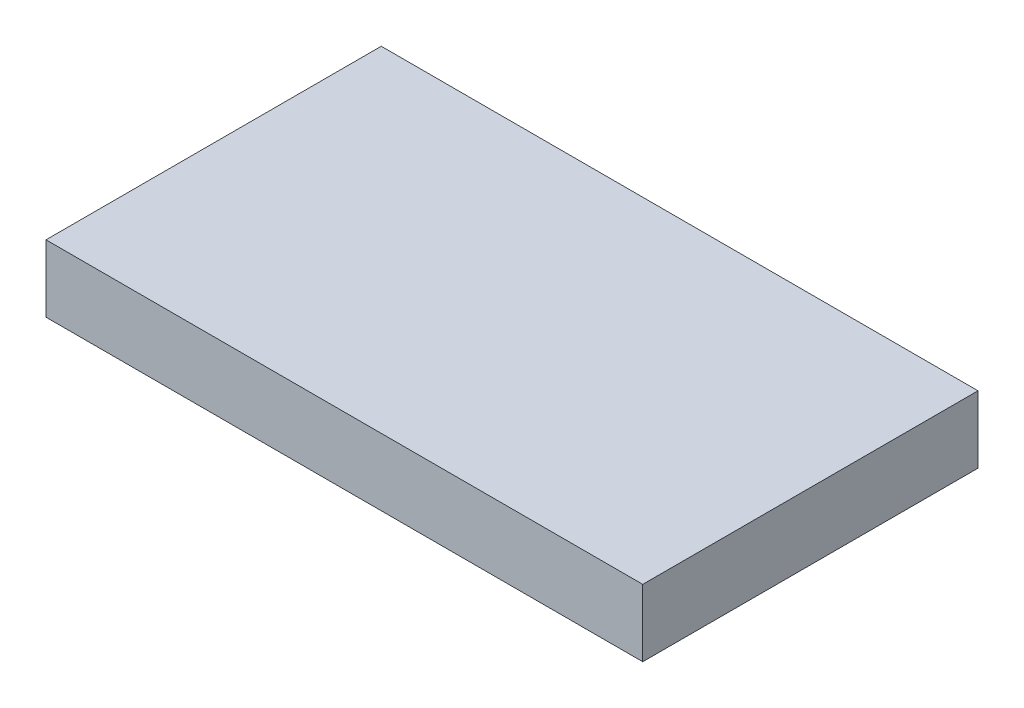
ISO-10303-21;
HEADER;
FILE_DESCRIPTION(('STEP AP214'),'2;1');
FILE_NAME('part.step','',(''),(''),'','','');
FILE_SCHEMA(('AUTOMOTIVE_DESIGN { 1 0 10303 214 1 1 1 1 }'));
ENDSEC;
DATA;
#1=APPLICATION_CONTEXT('core data for automotive mechanical design processes');
#2=APPLICATION_PROTOCOL_DEFINITION('international standard','automotive_design',2000,#1);
#3=PRODUCT_CONTEXT('',#1,'mechanical');
#4=PRODUCT('Part','Part','',(#3));
#5=PRODUCT_RELATED_PRODUCT_CATEGORY('part','',(#4));
#6=PRODUCT_DEFINITION_FORMATION('','',#4);
#7=PRODUCT_DEFINITION_CONTEXT('part definition',#1,'design');
#8=PRODUCT_DEFINITION('design','',#6,#7);
#9=PRODUCT_DEFINITION_SHAPE('','',#8);
#10=(LENGTH_UNIT() NAMED_UNIT(*) SI_UNIT(.MILLI.,.METRE.));
#11=(NAMED_UNIT(*) PLANE_ANGLE_UNIT() SI_UNIT($,.RADIAN.));
#12=(NAMED_UNIT(*) SI_UNIT($,.STERADIAN.) SOLID_ANGLE_UNIT());
#13=UNCERTAINTY_MEASURE_WITH_UNIT(LENGTH_MEASURE(1.E-05),#10,'distance_accuracy_value','');
#14=(GEOMETRIC_REPRESENTATION_CONTEXT(3) GLOBAL_UNCERTAINTY_ASSIGNED_CONTEXT((#13)) GLOBAL_UNIT_ASSIGNED_CONTEXT((#10,
#11,#12)) REPRESENTATION_CONTEXT('',''));
#15=CARTESIAN_POINT('',(0.,0.,0.));
#16=DIRECTION('',(0.,0.,1.));
#17=DIRECTION('',(1.,0.,0.));
#18=AXIS2_PLACEMENT_3D('',#15,#16,#17);
#19=CARTESIAN_POINT('',(0.,20.,0.));
#20=DIRECTION('',(0.,0.,-1.));
#21=DIRECTION('',(-1.,0.,0.));
#22=AXIS2_PLACEMENT_3D('',#19,#20,#21);
#23=PLANE('',#22);
#24=DIRECTION('',(0.,-1.,0.));
#25=VECTOR('',#24,1.);
#26=CARTESIAN_POINT('',(178.,0.,0.));
#27=LINE('',#26,#25);
#28=CARTESIAN_POINT('',(178.,20.,0.));
#29=VERTEX_POINT('',#28);
#30=CARTESIAN_POINT('',(178.,0.,0.));
#31=VERTEX_POINT('',#30);
#32=EDGE_CURVE('E69',#29,#31,#27,.T.);
#33=ORIENTED_EDGE('',*,*,#32,.F.);
#34=DIRECTION('',(1.,0.,0.));
#35=VECTOR('',#34,1.);
#36=CARTESIAN_POINT('',(0.,20.,0.));
#37=LINE('',#36,#35);
#38=CARTESIAN_POINT('',(0.,20.,0.));
#39=VERTEX_POINT('',#38);
#40=EDGE_CURVE('E91',#39,#29,#37,.T.);
#41=ORIENTED_EDGE('',*,*,#40,.F.);
#42=DIRECTION('',(0.,-1.,0.));
#43=VECTOR('',#42,1.);
#44=CARTESIAN_POINT('',(0.,20.,0.));
#45=LINE('',#44,#43);
#46=CARTESIAN_POINT('',(0.,0.,0.));
#47=VERTEX_POINT('',#46);
#48=EDGE_CURVE('E12',#39,#47,#45,.T.);
#49=ORIENTED_EDGE('',*,*,#48,.T.);
#50=DIRECTION('',(1.,0.,0.));
#51=VECTOR('',#50,1.);
#52=CARTESIAN_POINT('',(0.,0.,0.));
#53=LINE('',#52,#51);
#54=EDGE_CURVE('E89',#47,#31,#53,.T.);
#55=ORIENTED_EDGE('',*,*,#54,.T.);
#56=EDGE_LOOP('',(#33,#41,#49,#55));
#57=FACE_BOUND('',#56,.T.);
#58=ADVANCED_FACE('F54',(#57),#23,.F.);
#59=CARTESIAN_POINT('',(0.,20.,-100.));
#60=DIRECTION('',(0.,0.,-1.));
#61=DIRECTION('',(-1.,0.,0.));
#62=AXIS2_PLACEMENT_3D('',#59,#60,#61);
#63=PLANE('',#62);
#64=DIRECTION('',(1.,0.,0.));
#65=VECTOR('',#64,1.);
#66=CARTESIAN_POINT('',(0.,20.,-100.));
#67=LINE('',#66,#65);
#68=CARTESIAN_POINT('',(0.,20.,-100.));
#69=VERTEX_POINT('',#68);
#70=CARTESIAN_POINT('',(178.,20.,-100.));
#71=VERTEX_POINT('',#70);
#72=EDGE_CURVE('E110',#69,#71,#67,.T.);
#73=ORIENTED_EDGE('',*,*,#72,.T.);
#74=DIRECTION('',(0.,1.,0.));
#75=VECTOR('',#74,1.);
#76=CARTESIAN_POINT('',(178.,0.,-100.));
#77=LINE('',#76,#75);
#78=CARTESIAN_POINT('',(178.,0.,-100.));
#79=VERTEX_POINT('',#78);
#80=EDGE_CURVE('E106',#79,#71,#77,.T.);
#81=ORIENTED_EDGE('',*,*,#80,.F.);
#82=DIRECTION('',(1.,0.,0.));
#83=VECTOR('',#82,1.);
#84=CARTESIAN_POINT('',(0.,0.,-100.));
#85=LINE('',#84,#83);
#86=CARTESIAN_POINT('',(0.,0.,-100.));
#87=VERTEX_POINT('',#86);
#88=EDGE_CURVE('E100',#87,#79,#85,.T.);
#89=ORIENTED_EDGE('',*,*,#88,.F.);
#90=DIRECTION('',(0.,-1.,0.));
#91=VECTOR('',#90,1.);
#92=CARTESIAN_POINT('',(0.,20.,-100.));
#93=LINE('',#92,#91);
#94=EDGE_CURVE('E58',#69,#87,#93,.T.);
#95=ORIENTED_EDGE('',*,*,#94,.F.);
#96=EDGE_LOOP('',(#73,#81,#89,#95));
#97=FACE_BOUND('',#96,.T.);
#98=ADVANCED_FACE('F124',(#97),#63,.T.);
#99=CARTESIAN_POINT('',(0.,20.,0.));
#100=DIRECTION('',(0.,-1.,0.));
#101=DIRECTION('',(0.,0.,-1.));
#102=AXIS2_PLACEMENT_3D('',#99,#100,#101);
#103=PLANE('',#102);
#104=DIRECTION('',(0.,0.,1.));
#105=VECTOR('',#104,1.);
#106=CARTESIAN_POINT('',(178.,20.,0.));
#107=LINE('',#106,#105);
#108=EDGE_CURVE('E103',#71,#29,#107,.T.);
#109=ORIENTED_EDGE('',*,*,#108,.F.);
#110=ORIENTED_EDGE('',*,*,#72,.F.);
#111=DIRECTION('',(0.,0.,-1.));
#112=VECTOR('',#111,1.);
#113=CARTESIAN_POINT('',(0.,20.,0.));
#114=LINE('',#113,#112);
#115=EDGE_CURVE('E99',#39,#69,#114,.T.);
#116=ORIENTED_EDGE('',*,*,#115,.F.);
#117=ORIENTED_EDGE('',*,*,#40,.T.);
#118=EDGE_LOOP('',(#109,#110,#116,#117));
#119=FACE_BOUND('',#118,.T.);
#120=ADVANCED_FACE('F128',(#119),#103,.F.);
#121=CARTESIAN_POINT('',(0.,0.,0.));
#122=DIRECTION('',(0.,-1.,0.));
#123=DIRECTION('',(0.,0.,-1.));
#124=AXIS2_PLACEMENT_3D('',#121,#122,#123);
#125=PLANE('',#124);
#126=ORIENTED_EDGE('',*,*,#88,.T.);
#127=DIRECTION('',(0.,0.,-1.));
#128=VECTOR('',#127,1.);
#129=CARTESIAN_POINT('',(178.,0.,0.));
#130=LINE('',#129,#128);
#131=EDGE_CURVE('E98',#31,#79,#130,.T.);
#132=ORIENTED_EDGE('',*,*,#131,.F.);
#133=ORIENTED_EDGE('',*,*,#54,.F.);
#134=DIRECTION('',(0.,0.,-1.));
#135=VECTOR('',#134,1.);
#136=CARTESIAN_POINT('',(0.,0.,0.));
#137=LINE('',#136,#135);
#138=EDGE_CURVE('E97',#47,#87,#137,.T.);
#139=ORIENTED_EDGE('',*,*,#138,.T.);
#140=EDGE_LOOP('',(#126,#132,#133,#139));
#141=FACE_BOUND('',#140,.T.);
#142=ADVANCED_FACE('F96',(#141),#125,.T.);
#143=CARTESIAN_POINT('',(0.,20.,0.));
#144=DIRECTION('',(-1.,0.,0.));
#145=DIRECTION('',(0.,0.,1.));
#146=AXIS2_PLACEMENT_3D('',#143,#144,#145);
#147=PLANE('',#146);
#148=ORIENTED_EDGE('',*,*,#138,.F.);
#149=ORIENTED_EDGE('',*,*,#48,.F.);
#150=ORIENTED_EDGE('',*,*,#115,.T.);
#151=ORIENTED_EDGE('',*,*,#94,.T.);
#152=EDGE_LOOP('',(#148,#149,#150,#151));
#153=FACE_BOUND('',#152,.T.);
#154=ADVANCED_FACE('F56',(#153),#147,.T.);
#155=CARTESIAN_POINT('',(178.,0.,0.));
#156=DIRECTION('',(1.,0.,0.));
#157=DIRECTION('',(0.,0.,-1.));
#158=AXIS2_PLACEMENT_3D('',#155,#156,#157);
#159=PLANE('',#158);
#160=ORIENTED_EDGE('',*,*,#32,.T.);
#161=ORIENTED_EDGE('',*,*,#131,.T.);
#162=ORIENTED_EDGE('',*,*,#80,.T.);
#163=ORIENTED_EDGE('',*,*,#108,.T.);
#164=EDGE_LOOP('',(#160,#161,#162,#163));
#165=FACE_BOUND('',#164,.T.);
#166=ADVANCED_FACE('F119',(#165),#159,.T.);
#167=CLOSED_SHELL('',(#58,#98,#120,#142,#154,#166));
#168=MANIFOLD_SOLID_BREP('B2',#167);
#169=ADVANCED_BREP_SHAPE_REPRESENTATION('',(#18,#168),#14);
#170=SHAPE_DEFINITION_REPRESENTATION(#9,#169);
ENDSEC;
END-ISO-10303-21;
